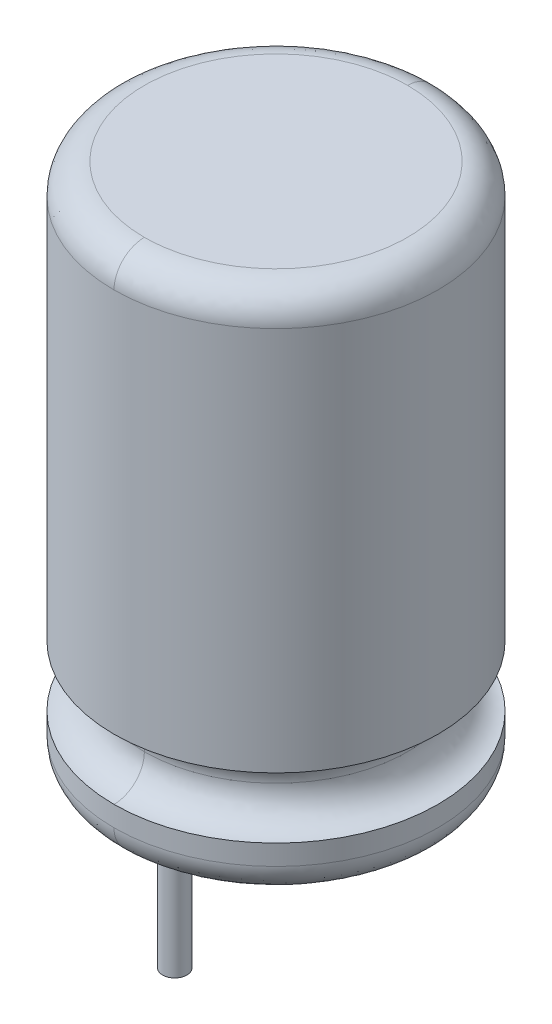
ISO-10303-21;
HEADER;
FILE_DESCRIPTION(('STEP AP214'),'2;1');
FILE_NAME('part.step','',(''),(''),'','','');
FILE_SCHEMA(('AUTOMOTIVE_DESIGN { 1 0 10303 214 1 1 1 1 }'));
ENDSEC;
DATA;
#1=APPLICATION_CONTEXT('core data for automotive mechanical design processes');
#2=APPLICATION_PROTOCOL_DEFINITION('international standard','automotive_design',2000,#1);
#3=PRODUCT_CONTEXT('',#1,'mechanical');
#4=PRODUCT('Part','Part','',(#3));
#5=PRODUCT_RELATED_PRODUCT_CATEGORY('part','',(#4));
#6=PRODUCT_DEFINITION_FORMATION('','',#4);
#7=PRODUCT_DEFINITION_CONTEXT('part definition',#1,'design');
#8=PRODUCT_DEFINITION('design','',#6,#7);
#9=PRODUCT_DEFINITION_SHAPE('','',#8);
#10=(LENGTH_UNIT() NAMED_UNIT(*) SI_UNIT(.MILLI.,.METRE.));
#11=(NAMED_UNIT(*) PLANE_ANGLE_UNIT() SI_UNIT($,.RADIAN.));
#12=(NAMED_UNIT(*) SI_UNIT($,.STERADIAN.) SOLID_ANGLE_UNIT());
#13=UNCERTAINTY_MEASURE_WITH_UNIT(LENGTH_MEASURE(1.E-05),#10,'distance_accuracy_value','');
#14=(GEOMETRIC_REPRESENTATION_CONTEXT(3) GLOBAL_UNCERTAINTY_ASSIGNED_CONTEXT((#13)) GLOBAL_UNIT_ASSIGNED_CONTEXT((#10,
#11,#12)) REPRESENTATION_CONTEXT('',''));
#15=CARTESIAN_POINT('',(0.,0.,0.));
#16=DIRECTION('',(0.,0.,1.));
#17=DIRECTION('',(1.,0.,0.));
#18=AXIS2_PLACEMENT_3D('',#15,#16,#17);
#19=CARTESIAN_POINT('',(0.3036,-3.,-2.8036));
#20=DIRECTION('',(0.,-1.,0.));
#21=DIRECTION('',(0.,0.,1.));
#22=AXIS2_PLACEMENT_3D('',#19,#20,#21);
#23=PLANE('',#22);
#24=CARTESIAN_POINT('',(0.,-3.,-2.5));
#25=DIRECTION('',(0.,1.,0.));
#26=DIRECTION('',(0.,0.,1.));
#27=AXIS2_PLACEMENT_3D('',#24,#25,#26);
#28=CIRCLE('',#27,0.3);
#29=CARTESIAN_POINT('',(0.,-3.,-2.2));
#30=VERTEX_POINT('',#29);
#31=EDGE_CURVE('E21',#30,#30,#28,.F.);
#32=ORIENTED_EDGE('',*,*,#31,.T.);
#33=EDGE_LOOP('',(#32));
#34=FACE_BOUND('',#33,.T.);
#35=ADVANCED_FACE('F16',(#34),#23,.T.);
#36=CARTESIAN_POINT('',(-0.3036,-3.,2.8036));
#37=DIRECTION('',(0.,-1.,0.));
#38=DIRECTION('',(0.,0.,-1.));
#39=AXIS2_PLACEMENT_3D('',#36,#37,#38);
#40=PLANE('',#39);
#41=CARTESIAN_POINT('',(0.,-3.,2.5));
#42=DIRECTION('',(0.,1.,0.));
#43=DIRECTION('',(0.,0.,1.));
#44=AXIS2_PLACEMENT_3D('',#41,#42,#43);
#45=CIRCLE('',#44,0.3);
#46=CARTESIAN_POINT('',(0.,-3.,2.8));
#47=VERTEX_POINT('',#46);
#48=EDGE_CURVE('E248',#47,#47,#45,.F.);
#49=ORIENTED_EDGE('',*,*,#48,.T.);
#50=EDGE_LOOP('',(#49));
#51=FACE_BOUND('',#50,.T.);
#52=ADVANCED_FACE('F193',(#51),#40,.T.);
#53=CARTESIAN_POINT('',(0.,2.074875062,3.253746876));
#54=CARTESIAN_POINT('',(-6.507493752,2.074875062,3.253746876));
#55=CARTESIAN_POINT('',(-6.507493752,2.074875062,-3.253746876));
#56=CARTESIAN_POINT('',(0.,2.074875062,-3.253746876));
#57=CARTESIAN_POINT('',(0.,1.564959676,3.202584683));
#58=CARTESIAN_POINT('',(-6.405169366,1.564959676,3.202584683));
#59=CARTESIAN_POINT('',(-6.405169366,1.564959676,-3.202584683));
#60=CARTESIAN_POINT('',(0.,1.564959676,-3.202584683));
#61=CARTESIAN_POINT('',(0.,1.202584683,3.564959676));
#62=CARTESIAN_POINT('',(-7.129919352,1.202584683,3.564959676));
#63=CARTESIAN_POINT('',(-7.129919352,1.202584683,-3.564959676));
#64=CARTESIAN_POINT('',(0.,1.202584683,-3.564959676));
#65=CARTESIAN_POINT('',(0.,1.253746876,4.074875062));
#66=CARTESIAN_POINT('',(-8.149750125,1.253746876,4.074875062));
#67=CARTESIAN_POINT('',(-8.149750125,1.253746876,-4.074875062));
#68=CARTESIAN_POINT('',(0.,1.253746876,-4.074875062));
#69=(BOUNDED_SURFACE() B_SPLINE_SURFACE(3,3,((#53,#54,#55,#56),(#57,#58,#59,#60),(#61,#62,#63,
#64),(#65,#66,#67,#68)),.UNSPECIFIED.,.F.,.F.,.F.) B_SPLINE_SURFACE_WITH_KNOTS((4,4),(4,4),(0.,
1.),(0.,1.),.UNSPECIFIED.) GEOMETRIC_REPRESENTATION_ITEM() RATIONAL_B_SPLINE_SURFACE(((1.,
0.333333333333333,0.333333333333333,1.),(0.755320871117972,0.251773623705991,0.251773623705991,
0.755320871117972),(0.755320871117972,0.251773623705991,0.251773623705991,0.755320871117972),
(1.,0.333333333333333,0.333333333333333,1.))) REPRESENTATION_ITEM('') SURFACE());
#70=CARTESIAN_POINT('',(0.,2.00000000077527,0.));
#71=DIRECTION('',(0.,-1.,0.));
#72=DIRECTION('',(1.,0.,0.));
#73=AXIS2_PLACEMENT_3D('',#70,#71,#72);
#74=CIRCLE('',#73,3.2499999999693);
#75=CARTESIAN_POINT('',(0.,2.,3.2499999999693));
#76=VERTEX_POINT('',#75);
#77=CARTESIAN_POINT('',(0.,2.,-3.2499999999693));
#78=VERTEX_POINT('',#77);
#79=EDGE_CURVE('E257',#76,#78,#74,.T.);
#80=CARTESIAN_POINT('',(0.,2.074875062,-3.253746876));
#81=CARTESIAN_POINT('',(0.,1.564959676,-3.202584683));
#82=CARTESIAN_POINT('',(0.,1.202584683,-3.564959676));
#83=CARTESIAN_POINT('',(0.,1.253746876,-4.074875062));
#84=(BOUNDED_CURVE() B_SPLINE_CURVE(3,(#80,#81,#82,#83),.UNSPECIFIED.,.F.,
.F.) B_SPLINE_CURVE_WITH_KNOTS((4,4),(0.,1.),
.UNSPECIFIED.) CURVE() GEOMETRIC_REPRESENTATION_ITEM() RATIONAL_B_SPLINE_CURVE((1.,
0.755320871117972,0.755320871117972,1.)) REPRESENTATION_ITEM(''));
#85=CARTESIAN_POINT('',(-4.78899351590904E-10,1.24999999997953,-3.99999999948316));
#86=VERTEX_POINT('',#85);
#87=EDGE_CURVE('E73',#86,#78,#84,.F.);
#88=CARTESIAN_POINT('',(0.,1.2499999999693,0.));
#89=DIRECTION('',(0.,-1.,0.));
#90=DIRECTION('',(1.,0.,0.));
#91=AXIS2_PLACEMENT_3D('',#88,#89,#90);
#92=CIRCLE('',#91,3.99999999922473);
#93=CARTESIAN_POINT('',(-1.64082742812265E-09,1.25,4.));
#94=VERTEX_POINT('',#93);
#95=EDGE_CURVE('E296',#94,#86,#92,.T.);
#96=CARTESIAN_POINT('',(0.,2.074875062,3.253746876));
#97=CARTESIAN_POINT('',(0.,1.564959676,3.202584683));
#98=CARTESIAN_POINT('',(0.,1.202584683,3.564959676));
#99=CARTESIAN_POINT('',(0.,1.253746876,4.074875062));
#100=(BOUNDED_CURVE() B_SPLINE_CURVE(3,(#96,#97,#98,#99),.UNSPECIFIED.,.F.,
.F.) B_SPLINE_CURVE_WITH_KNOTS((4,4),(0.,1.),
.UNSPECIFIED.) CURVE() GEOMETRIC_REPRESENTATION_ITEM() RATIONAL_B_SPLINE_CURVE((1.,
0.755320871117972,0.755320871117972,1.)) REPRESENTATION_ITEM(''));
#101=EDGE_CURVE('E100',#76,#94,#100,.T.);
#102=ORIENTED_EDGE('',*,*,#79,.T.);
#103=ORIENTED_EDGE('',*,*,#87,.F.);
#104=ORIENTED_EDGE('',*,*,#95,.F.);
#105=ORIENTED_EDGE('',*,*,#101,.F.);
#106=EDGE_LOOP('',(#102,#103,#104,#105));
#107=FACE_BOUND('',#106,.T.);
#108=ADVANCED_FACE('F183',(#107),#69,.F.);
#109=CARTESIAN_POINT('',(0.,0.824875062,-3.996253124));
#110=CARTESIAN_POINT('',(-7.992506248,0.824875062,-3.996253124));
#111=CARTESIAN_POINT('',(-7.992506248,0.824875062,3.996253124));
#112=CARTESIAN_POINT('',(0.,0.824875062,3.996253124));
#113=CARTESIAN_POINT('',(0.,0.314959676,-4.047415317));
#114=CARTESIAN_POINT('',(-8.094830634,0.314959676,-4.047415317));
#115=CARTESIAN_POINT('',(-8.094830634,0.314959676,4.047415317));
#116=CARTESIAN_POINT('',(0.,0.314959676,4.047415317));
#117=CARTESIAN_POINT('',(0.,-0.047415317,-3.685040324));
#118=CARTESIAN_POINT('',(-7.370080648,-0.047415317,-3.685040324));
#119=CARTESIAN_POINT('',(-7.370080648,-0.047415317,3.685040324));
#120=CARTESIAN_POINT('',(0.,-0.047415317,3.685040324));
#121=CARTESIAN_POINT('',(0.,0.003746876,-3.175124938));
#122=CARTESIAN_POINT('',(-6.350249875,0.003746876,-3.175124938));
#123=CARTESIAN_POINT('',(-6.350249875,0.003746876,3.175124938));
#124=CARTESIAN_POINT('',(0.,0.003746876,3.175124938));
#125=(BOUNDED_SURFACE() B_SPLINE_SURFACE(3,3,((#109,#110,#111,#112),(#113,#114,#115,#116),(#117,
#118,#119,#120),(#121,#122,#123,#124)),.UNSPECIFIED.,.F.,.F.,
.F.) B_SPLINE_SURFACE_WITH_KNOTS((4,4),(4,4),(0.,1.),(0.,1.),
.UNSPECIFIED.) GEOMETRIC_REPRESENTATION_ITEM() RATIONAL_B_SPLINE_SURFACE(((1.,0.333333333333333,
0.333333333333333,1.),(0.755320871117972,0.251773623705991,0.251773623705991,0.755320871117972),
(0.755320871117972,0.251773623705991,0.251773623705991,0.755320871117972),(1.,0.333333333333333,
0.333333333333333,1.))) REPRESENTATION_ITEM('') SURFACE());
#126=CARTESIAN_POINT('',(0.,0.824875062,3.996253124));
#127=CARTESIAN_POINT('',(0.,0.314959676,4.047415317));
#128=CARTESIAN_POINT('',(0.,-0.047415317,3.685040324));
#129=CARTESIAN_POINT('',(0.,0.003746876,3.175124938));
#130=(BOUNDED_CURVE() B_SPLINE_CURVE(3,(#126,#127,#128,#129),.UNSPECIFIED.,.F.,
.F.) B_SPLINE_CURVE_WITH_KNOTS((4,4),(0.,1.),
.UNSPECIFIED.) CURVE() GEOMETRIC_REPRESENTATION_ITEM() RATIONAL_B_SPLINE_CURVE((1.,
0.755320871117972,0.755320871117972,1.)) REPRESENTATION_ITEM(''));
#131=CARTESIAN_POINT('',(0.,-1.84214021285393E-11,3.24999999990695));
#132=VERTEX_POINT('',#131);
#133=CARTESIAN_POINT('',(-4.10206857030662E-10,0.749999999418551,4.00000000001535));
#134=VERTEX_POINT('',#133);
#135=EDGE_CURVE('E93',#132,#134,#130,.F.);
#136=CARTESIAN_POINT('',(0.,0.749999999224735,0.));
#137=DIRECTION('',(0.,-1.,0.));
#138=DIRECTION('',(1.,0.,0.));
#139=AXIS2_PLACEMENT_3D('',#136,#137,#138);
#140=CIRCLE('',#139,4.0000000000307);
#141=CARTESIAN_POINT('',(-2.69380885286544E-10,0.749999999483157,-4.00000000001535));
#142=VERTEX_POINT('',#141);
#143=EDGE_CURVE('E82',#134,#142,#140,.T.);
#144=CARTESIAN_POINT('',(0.,0.824875062,-3.996253124));
#145=CARTESIAN_POINT('',(0.,0.314959676,-4.047415317));
#146=CARTESIAN_POINT('',(0.,-0.047415317,-3.685040324));
#147=CARTESIAN_POINT('',(0.,0.003746876,-3.175124938));
#148=(BOUNDED_CURVE() B_SPLINE_CURVE(3,(#144,#145,#146,#147),.UNSPECIFIED.,.F.,
.F.) B_SPLINE_CURVE_WITH_KNOTS((4,4),(0.,1.),
.UNSPECIFIED.) CURVE() GEOMETRIC_REPRESENTATION_ITEM() RATIONAL_B_SPLINE_CURVE((1.,
0.755320871117972,0.755320871117972,1.)) REPRESENTATION_ITEM(''));
#149=CARTESIAN_POINT('',(0.,-1.84214021285393E-11,-3.24999999990695));
#150=VERTEX_POINT('',#149);
#151=EDGE_CURVE('E91',#142,#150,#148,.T.);
#152=CARTESIAN_POINT('',(0.,-3.07023371557678E-11,-3.25000000099174));
#153=CARTESIAN_POINT('',(-6.50000000112388,-3.07023432738572E-11,-3.25000000099174));
#154=CARTESIAN_POINT('',(-6.50000000112388,-3.07023432738572E-11,3.25000000099174));
#155=CARTESIAN_POINT('',(0.,-3.07023371557678E-11,3.25000000099174));
#156=(BOUNDED_CURVE() B_SPLINE_CURVE(3,(#152,#153,#154,#155),.UNSPECIFIED.,.F.,
.F.) B_SPLINE_CURVE_WITH_KNOTS((4,4),(0.,1.),
.UNSPECIFIED.) CURVE() GEOMETRIC_REPRESENTATION_ITEM() RATIONAL_B_SPLINE_CURVE((0.956578302051627,
0.318859434017209,0.318859434017209,0.956578302051627)) REPRESENTATION_ITEM(''));
#157=EDGE_CURVE('E233',#150,#132,#156,.T.);
#158=ORIENTED_EDGE('',*,*,#135,.T.);
#159=ORIENTED_EDGE('',*,*,#143,.T.);
#160=ORIENTED_EDGE('',*,*,#151,.T.);
#161=ORIENTED_EDGE('',*,*,#157,.T.);
#162=EDGE_LOOP('',(#158,#159,#160,#161));
#163=FACE_BOUND('',#162,.T.);
#164=ADVANCED_FACE('F89',(#163),#125,.T.);
#165=CARTESIAN_POINT('',(0.,-3.,-2.5));
#166=DIRECTION('',(0.,1.,0.));
#167=DIRECTION('',(0.,0.,1.));
#168=AXIS2_PLACEMENT_3D('',#165,#166,#167);
#169=CYLINDRICAL_SURFACE('',#168,0.3);
#170=CARTESIAN_POINT('',(0.,0.,-2.5));
#171=DIRECTION('',(0.,1.,0.));
#172=DIRECTION('',(0.,0.,1.));
#173=AXIS2_PLACEMENT_3D('',#170,#171,#172);
#174=CIRCLE('',#173,0.3);
#175=CARTESIAN_POINT('',(0.,0.,-2.2));
#176=VERTEX_POINT('',#175);
#177=EDGE_CURVE('E246',#176,#176,#174,.F.);
#178=ORIENTED_EDGE('',*,*,#177,.T.);
#179=EDGE_LOOP('',(#178));
#180=FACE_BOUND('',#179,.T.);
#181=ORIENTED_EDGE('',*,*,#31,.F.);
#182=EDGE_LOOP('',(#181));
#183=FACE_BOUND('',#182,.T.);
#184=ADVANCED_FACE('F174',(#180,#183),#169,.T.);
#185=CARTESIAN_POINT('',(0.,-3.,2.5));
#186=DIRECTION('',(0.,1.,0.));
#187=DIRECTION('',(0.,0.,1.));
#188=AXIS2_PLACEMENT_3D('',#185,#186,#187);
#189=CYLINDRICAL_SURFACE('',#188,0.3);
#190=ORIENTED_EDGE('',*,*,#48,.F.);
#191=EDGE_LOOP('',(#190));
#192=FACE_BOUND('',#191,.T.);
#193=CARTESIAN_POINT('',(0.,0.,2.5));
#194=DIRECTION('',(0.,1.,0.));
#195=DIRECTION('',(0.,0.,1.));
#196=AXIS2_PLACEMENT_3D('',#193,#194,#195);
#197=CIRCLE('',#196,0.3);
#198=CARTESIAN_POINT('',(0.,0.,2.8));
#199=VERTEX_POINT('',#198);
#200=EDGE_CURVE('E237',#199,#199,#197,.F.);
#201=ORIENTED_EDGE('',*,*,#200,.T.);
#202=EDGE_LOOP('',(#201));
#203=FACE_BOUND('',#202,.T.);
#204=ADVANCED_FACE('F165',(#192,#203),#189,.T.);
#205=CARTESIAN_POINT('',(0.,2.746253124,4.074875062));
#206=CARTESIAN_POINT('',(-8.149750125,2.746253124,4.074875062));
#207=CARTESIAN_POINT('',(-8.149750125,2.746253124,-4.074875062));
#208=CARTESIAN_POINT('',(0.,2.746253124,-4.074875062));
#209=CARTESIAN_POINT('',(0.,2.797415317,3.564959676));
#210=CARTESIAN_POINT('',(-7.129919352,2.797415317,3.564959676));
#211=CARTESIAN_POINT('',(-7.129919352,2.797415317,-3.564959676));
#212=CARTESIAN_POINT('',(0.,2.797415317,-3.564959676));
#213=CARTESIAN_POINT('',(0.,2.435040324,3.202584683));
#214=CARTESIAN_POINT('',(-6.405169366,2.435040324,3.202584683));
#215=CARTESIAN_POINT('',(-6.405169366,2.435040324,-3.202584683));
#216=CARTESIAN_POINT('',(0.,2.435040324,-3.202584683));
#217=CARTESIAN_POINT('',(0.,1.925124938,3.253746876));
#218=CARTESIAN_POINT('',(-6.507493752,1.925124938,3.253746876));
#219=CARTESIAN_POINT('',(-6.507493752,1.925124938,-3.253746876));
#220=CARTESIAN_POINT('',(0.,1.925124938,-3.253746876));
#221=(BOUNDED_SURFACE() B_SPLINE_SURFACE(3,3,((#205,#206,#207,#208),(#209,#210,#211,#212),(#213,
#214,#215,#216),(#217,#218,#219,#220)),.UNSPECIFIED.,.F.,.F.,
.F.) B_SPLINE_SURFACE_WITH_KNOTS((4,4),(4,4),(0.,1.),(0.,1.),
.UNSPECIFIED.) GEOMETRIC_REPRESENTATION_ITEM() RATIONAL_B_SPLINE_SURFACE(((1.,0.333333333333333,
0.333333333333333,1.),(0.755320871117972,0.251773623705991,0.251773623705991,0.755320871117972),
(0.755320871117972,0.251773623705991,0.251773623705991,0.755320871117972),(1.,0.333333333333333,
0.333333333333333,1.))) REPRESENTATION_ITEM('') SURFACE());
#222=CARTESIAN_POINT('',(0.,2.746253124,4.074875062));
#223=CARTESIAN_POINT('',(0.,2.797415317,3.564959676));
#224=CARTESIAN_POINT('',(0.,2.435040324,3.202584683));
#225=CARTESIAN_POINT('',(0.,1.925124938,3.253746876));
#226=(BOUNDED_CURVE() B_SPLINE_CURVE(3,(#222,#223,#224,#225),.UNSPECIFIED.,.F.,
.F.) B_SPLINE_CURVE_WITH_KNOTS((4,4),(0.,1.),
.UNSPECIFIED.) CURVE() GEOMETRIC_REPRESENTATION_ITEM() RATIONAL_B_SPLINE_CURVE((1.,
0.755320871117972,0.755320871117972,1.)) REPRESENTATION_ITEM(''));
#227=CARTESIAN_POINT('',(-6.15310285545994E-10,2.75000000001919,3.99999999951546));
#228=VERTEX_POINT('',#227);
#229=EDGE_CURVE('E251',#228,#76,#226,.T.);
#230=CARTESIAN_POINT('',(0.,2.75,0.));
#231=DIRECTION('',(0.,-1.,0.));
#232=DIRECTION('',(0.,0.,-1.));
#233=AXIS2_PLACEMENT_3D('',#230,#231,#232);
#234=CIRCLE('',#233,4.);
#235=CARTESIAN_POINT('',(-1.79587256857466E-10,2.75000000001919,-3.99999999951546));
#236=VERTEX_POINT('',#235);
#237=EDGE_CURVE('E245',#228,#236,#234,.T.);
#238=CARTESIAN_POINT('',(0.,2.746253124,-4.074875062));
#239=CARTESIAN_POINT('',(0.,2.797415317,-3.564959676));
#240=CARTESIAN_POINT('',(0.,2.435040324,-3.202584683));
#241=CARTESIAN_POINT('',(0.,1.925124938,-3.253746876));
#242=(BOUNDED_CURVE() B_SPLINE_CURVE(3,(#238,#239,#240,#241),.UNSPECIFIED.,.F.,
.F.) B_SPLINE_CURVE_WITH_KNOTS((4,4),(0.,1.),
.UNSPECIFIED.) CURVE() GEOMETRIC_REPRESENTATION_ITEM() RATIONAL_B_SPLINE_CURVE((1.,
0.755320871117972,0.755320871117972,1.)) REPRESENTATION_ITEM(''));
#243=EDGE_CURVE('E35',#78,#236,#242,.F.);
#244=ORIENTED_EDGE('',*,*,#229,.F.);
#245=ORIENTED_EDGE('',*,*,#237,.T.);
#246=ORIENTED_EDGE('',*,*,#243,.F.);
#247=ORIENTED_EDGE('',*,*,#79,.F.);
#248=EDGE_LOOP('',(#244,#245,#246,#247));
#249=FACE_BOUND('',#248,.T.);
#250=ADVANCED_FACE('F150',(#249),#221,.F.);
#251=CARTESIAN_POINT('',(0.,12.996253124,-3.175124938));
#252=CARTESIAN_POINT('',(-6.350249875,12.996253124,-3.175124938));
#253=CARTESIAN_POINT('',(-6.350249875,12.996253124,3.175124938));
#254=CARTESIAN_POINT('',(0.,12.996253124,3.175124938));
#255=CARTESIAN_POINT('',(0.,13.047415317,-3.685040324));
#256=CARTESIAN_POINT('',(-7.370080648,13.047415317,-3.685040324));
#257=CARTESIAN_POINT('',(-7.370080648,13.047415317,3.685040324));
#258=CARTESIAN_POINT('',(0.,13.047415317,3.685040324));
#259=CARTESIAN_POINT('',(0.,12.685040324,-4.047415317));
#260=CARTESIAN_POINT('',(-8.094830634,12.685040324,-4.047415317));
#261=CARTESIAN_POINT('',(-8.094830634,12.685040324,4.047415317));
#262=CARTESIAN_POINT('',(0.,12.685040324,4.047415317));
#263=CARTESIAN_POINT('',(0.,12.175124938,-3.996253124));
#264=CARTESIAN_POINT('',(-7.992506248,12.175124938,-3.996253124));
#265=CARTESIAN_POINT('',(-7.992506248,12.175124938,3.996253124));
#266=CARTESIAN_POINT('',(0.,12.175124938,3.996253124));
#267=(BOUNDED_SURFACE() B_SPLINE_SURFACE(3,3,((#251,#252,#253,#254),(#255,#256,#257,#258),(#259,
#260,#261,#262),(#263,#264,#265,#266)),.UNSPECIFIED.,.F.,.F.,
.F.) B_SPLINE_SURFACE_WITH_KNOTS((4,4),(4,4),(0.,1.),(0.,1.),
.UNSPECIFIED.) GEOMETRIC_REPRESENTATION_ITEM() RATIONAL_B_SPLINE_SURFACE(((1.,0.333333333333333,
0.333333333333333,1.),(0.755320871117972,0.251773623705991,0.251773623705991,0.755320871117972),
(0.755320871117972,0.251773623705991,0.251773623705991,0.755320871117972),(1.,0.333333333333333,
0.333333333333333,1.))) REPRESENTATION_ITEM('') SURFACE());
#268=CARTESIAN_POINT('',(0.,12.996253124,3.175124938));
#269=CARTESIAN_POINT('',(0.,13.047415317,3.685040324));
#270=CARTESIAN_POINT('',(0.,12.685040324,4.047415317));
#271=CARTESIAN_POINT('',(0.,12.175124938,3.996253124));
#272=(BOUNDED_CURVE() B_SPLINE_CURVE(3,(#268,#269,#270,#271),.UNSPECIFIED.,.F.,
.F.) B_SPLINE_CURVE_WITH_KNOTS((4,4),(0.,1.),
.UNSPECIFIED.) CURVE() GEOMETRIC_REPRESENTATION_ITEM() RATIONAL_B_SPLINE_CURVE((1.,
0.755320871117972,0.755320871117972,1.)) REPRESENTATION_ITEM(''));
#273=CARTESIAN_POINT('',(0.,12.2500000004845,4.0000000000307));
#274=VERTEX_POINT('',#273);
#275=CARTESIAN_POINT('',(0.,13.0000000000184,3.24999999990695));
#276=VERTEX_POINT('',#275);
#277=EDGE_CURVE('E135',#274,#276,#272,.F.);
#278=CARTESIAN_POINT('',(0.,13.0000000000307,3.25000000099174));
#279=CARTESIAN_POINT('',(-6.50000000112388,13.0000000000307,3.25000000099174));
#280=CARTESIAN_POINT('',(-6.50000000112388,13.0000000000307,-3.25000000099174));
#281=CARTESIAN_POINT('',(0.,13.0000000000307,-3.25000000099174));
#282=(BOUNDED_CURVE() B_SPLINE_CURVE(3,(#278,#279,#280,#281),.UNSPECIFIED.,.F.,
.F.) B_SPLINE_CURVE_WITH_KNOTS((4,4),(0.,1.),
.UNSPECIFIED.) CURVE() GEOMETRIC_REPRESENTATION_ITEM() RATIONAL_B_SPLINE_CURVE((0.956578302051627,
0.318859434017209,0.318859434017209,0.956578302051627)) REPRESENTATION_ITEM(''));
#283=CARTESIAN_POINT('',(0.,13.0000000000184,-3.24999999990695));
#284=VERTEX_POINT('',#283);
#285=EDGE_CURVE('E129',#284,#276,#282,.F.);
#286=CARTESIAN_POINT('',(0.,12.996253124,-3.175124938));
#287=CARTESIAN_POINT('',(0.,13.047415317,-3.685040324));
#288=CARTESIAN_POINT('',(0.,12.685040324,-4.047415317));
#289=CARTESIAN_POINT('',(0.,12.175124938,-3.996253124));
#290=(BOUNDED_CURVE() B_SPLINE_CURVE(3,(#286,#287,#288,#289),.UNSPECIFIED.,.F.,
.F.) B_SPLINE_CURVE_WITH_KNOTS((4,4),(0.,1.),
.UNSPECIFIED.) CURVE() GEOMETRIC_REPRESENTATION_ITEM() RATIONAL_B_SPLINE_CURVE((1.,
0.755320871117972,0.755320871117972,1.)) REPRESENTATION_ITEM(''));
#291=CARTESIAN_POINT('',(-1.19724837904403E-10,12.2500000001615,-4.00000000001023));
#292=VERTEX_POINT('',#291);
#293=EDGE_CURVE('E268',#284,#292,#290,.T.);
#294=CARTESIAN_POINT('',(0.,12.25,0.));
#295=DIRECTION('',(0.,-1.,0.));
#296=DIRECTION('',(0.,0.,-1.));
#297=AXIS2_PLACEMENT_3D('',#294,#295,#296);
#298=CIRCLE('',#297,4.);
#299=EDGE_CURVE('E280',#292,#274,#298,.F.);
#300=ORIENTED_EDGE('',*,*,#277,.T.);
#301=ORIENTED_EDGE('',*,*,#285,.F.);
#302=ORIENTED_EDGE('',*,*,#293,.T.);
#303=ORIENTED_EDGE('',*,*,#299,.T.);
#304=EDGE_LOOP('',(#300,#301,#302,#303));
#305=FACE_BOUND('',#304,.T.);
#306=ADVANCED_FACE('F137',(#305),#267,.T.);
#307=CARTESIAN_POINT('',(-3.289,13.,-3.289));
#308=DIRECTION('',(0.,1.,0.));
#309=DIRECTION('',(0.,0.,1.));
#310=AXIS2_PLACEMENT_3D('',#307,#308,#309);
#311=PLANE('',#310);
#312=CARTESIAN_POINT('',(0.,13.0000000000307,-3.25000000099174));
#313=CARTESIAN_POINT('',(6.50000000112388,13.0000000000307,-3.25000000099174));
#314=CARTESIAN_POINT('',(6.50000000112388,13.0000000000307,3.25000000099174));
#315=CARTESIAN_POINT('',(0.,13.0000000000307,3.25000000099174));
#316=(BOUNDED_CURVE() B_SPLINE_CURVE(3,(#312,#313,#314,#315),.UNSPECIFIED.,.F.,
.F.) B_SPLINE_CURVE_WITH_KNOTS((4,4),(0.,1.),
.UNSPECIFIED.) CURVE() GEOMETRIC_REPRESENTATION_ITEM() RATIONAL_B_SPLINE_CURVE((0.956578302051627,
0.318859434017209,0.318859434017209,0.956578302051627)) REPRESENTATION_ITEM(''));
#317=EDGE_CURVE('E285',#284,#276,#316,.T.);
#318=ORIENTED_EDGE('',*,*,#317,.F.);
#319=ORIENTED_EDGE('',*,*,#285,.T.);
#320=EDGE_LOOP('',(#318,#319));
#321=FACE_BOUND('',#320,.T.);
#322=ADVANCED_FACE('F149',(#321),#311,.T.);
#323=CARTESIAN_POINT('',(-3.289,0.,-3.289));
#324=DIRECTION('',(0.,1.,0.));
#325=DIRECTION('',(0.,0.,1.));
#326=AXIS2_PLACEMENT_3D('',#323,#324,#325);
#327=PLANE('',#326);
#328=ORIENTED_EDGE('',*,*,#200,.F.);
#329=EDGE_LOOP('',(#328));
#330=FACE_BOUND('',#329,.T.);
#331=ORIENTED_EDGE('',*,*,#177,.F.);
#332=EDGE_LOOP('',(#331));
#333=FACE_BOUND('',#332,.T.);
#334=CARTESIAN_POINT('',(0.,-3.07023364895319E-11,3.25000000099174));
#335=CARTESIAN_POINT('',(6.50000000112388,-3.07023432622993E-11,3.25000000099174));
#336=CARTESIAN_POINT('',(6.50000000112388,-3.07023432622993E-11,-3.25000000099174));
#337=CARTESIAN_POINT('',(0.,-3.07023364895319E-11,-3.25000000099174));
#338=(BOUNDED_CURVE() B_SPLINE_CURVE(3,(#334,#335,#336,#337),.UNSPECIFIED.,.F.,
.F.) B_SPLINE_CURVE_WITH_KNOTS((4,4),(0.,1.),
.UNSPECIFIED.) CURVE() GEOMETRIC_REPRESENTATION_ITEM() RATIONAL_B_SPLINE_CURVE((0.956578302051627,
0.318859434017209,0.318859434017209,0.956578302051627)) REPRESENTATION_ITEM(''));
#339=EDGE_CURVE('E98',#132,#150,#338,.T.);
#340=ORIENTED_EDGE('',*,*,#339,.F.);
#341=ORIENTED_EDGE('',*,*,#157,.F.);
#342=EDGE_LOOP('',(#340,#341));
#343=FACE_BOUND('',#342,.T.);
#344=ADVANCED_FACE('F18',(#330,#333,#343),#327,.F.);
#345=CARTESIAN_POINT('',(0.,12.996253124,3.175124938));
#346=CARTESIAN_POINT('',(6.350249875,12.996253124,3.175124938));
#347=CARTESIAN_POINT('',(6.350249875,12.996253124,-3.175124938));
#348=CARTESIAN_POINT('',(0.,12.996253124,-3.175124938));
#349=CARTESIAN_POINT('',(0.,13.047415317,3.685040324));
#350=CARTESIAN_POINT('',(7.370080648,13.047415317,3.685040324));
#351=CARTESIAN_POINT('',(7.370080648,13.047415317,-3.685040324));
#352=CARTESIAN_POINT('',(0.,13.047415317,-3.685040324));
#353=CARTESIAN_POINT('',(0.,12.685040324,4.047415317));
#354=CARTESIAN_POINT('',(8.094830634,12.685040324,4.047415317));
#355=CARTESIAN_POINT('',(8.094830634,12.685040324,-4.047415317));
#356=CARTESIAN_POINT('',(0.,12.685040324,-4.047415317));
#357=CARTESIAN_POINT('',(0.,12.175124938,3.996253124));
#358=CARTESIAN_POINT('',(7.992506248,12.175124938,3.996253124));
#359=CARTESIAN_POINT('',(7.992506248,12.175124938,-3.996253124));
#360=CARTESIAN_POINT('',(0.,12.175124938,-3.996253124));
#361=(BOUNDED_SURFACE() B_SPLINE_SURFACE(3,3,((#345,#346,#347,#348),(#349,#350,#351,#352),(#353,
#354,#355,#356),(#357,#358,#359,#360)),.UNSPECIFIED.,.F.,.F.,
.F.) B_SPLINE_SURFACE_WITH_KNOTS((4,4),(4,4),(0.,1.),(0.,1.),
.UNSPECIFIED.) GEOMETRIC_REPRESENTATION_ITEM() RATIONAL_B_SPLINE_SURFACE(((1.,0.333333333333333,
0.333333333333333,1.),(0.755320871117972,0.251773623705991,0.251773623705991,0.755320871117972),
(0.755320871117972,0.251773623705991,0.251773623705991,0.755320871117972),(1.,0.333333333333333,
0.333333333333333,1.))) REPRESENTATION_ITEM('') SURFACE());
#362=CARTESIAN_POINT('',(0.,12.25,0.));
#363=DIRECTION('',(0.,-1.,0.));
#364=DIRECTION('',(0.,0.,-1.));
#365=AXIS2_PLACEMENT_3D('',#362,#363,#364);
#366=CIRCLE('',#365,4.);
#367=EDGE_CURVE('E86',#274,#292,#366,.F.);
#368=ORIENTED_EDGE('',*,*,#317,.T.);
#369=ORIENTED_EDGE('',*,*,#277,.F.);
#370=ORIENTED_EDGE('',*,*,#367,.T.);
#371=ORIENTED_EDGE('',*,*,#293,.F.);
#372=EDGE_LOOP('',(#368,#369,#370,#371));
#373=FACE_BOUND('',#372,.T.);
#374=ADVANCED_FACE('F151',(#373),#361,.T.);
#375=CARTESIAN_POINT('',(0.,0.824875062,3.996253124));
#376=CARTESIAN_POINT('',(7.992506248,0.824875062,3.996253124));
#377=CARTESIAN_POINT('',(7.992506248,0.824875062,-3.996253124));
#378=CARTESIAN_POINT('',(0.,0.824875062,-3.996253124));
#379=CARTESIAN_POINT('',(0.,0.314959676,4.047415317));
#380=CARTESIAN_POINT('',(8.094830634,0.314959676,4.047415317));
#381=CARTESIAN_POINT('',(8.094830634,0.314959676,-4.047415317));
#382=CARTESIAN_POINT('',(0.,0.314959676,-4.047415317));
#383=CARTESIAN_POINT('',(0.,-0.047415317,3.685040324));
#384=CARTESIAN_POINT('',(7.370080648,-0.047415317,3.685040324));
#385=CARTESIAN_POINT('',(7.370080648,-0.047415317,-3.685040324));
#386=CARTESIAN_POINT('',(0.,-0.047415317,-3.685040324));
#387=CARTESIAN_POINT('',(0.,0.003746876,3.175124938));
#388=CARTESIAN_POINT('',(6.350249875,0.003746876,3.175124938));
#389=CARTESIAN_POINT('',(6.350249875,0.003746876,-3.175124938));
#390=CARTESIAN_POINT('',(0.,0.003746876,-3.175124938));
#391=(BOUNDED_SURFACE() B_SPLINE_SURFACE(3,3,((#375,#376,#377,#378),(#379,#380,#381,#382),(#383,
#384,#385,#386),(#387,#388,#389,#390)),.UNSPECIFIED.,.F.,.F.,
.F.) B_SPLINE_SURFACE_WITH_KNOTS((4,4),(4,4),(0.,1.),(0.,1.),
.UNSPECIFIED.) GEOMETRIC_REPRESENTATION_ITEM() RATIONAL_B_SPLINE_SURFACE(((1.,0.333333333333333,
0.333333333333333,1.),(0.755320871117972,0.251773623705991,0.251773623705991,0.755320871117972),
(0.755320871117972,0.251773623705991,0.251773623705991,0.755320871117972),(1.,0.333333333333333,
0.333333333333333,1.))) REPRESENTATION_ITEM('') SURFACE());
#392=CARTESIAN_POINT('',(0.,0.750000000000001,0.));
#393=DIRECTION('',(0.,-1.,0.));
#394=DIRECTION('',(0.,0.,-1.));
#395=AXIS2_PLACEMENT_3D('',#392,#393,#394);
#396=CIRCLE('',#395,4.);
#397=EDGE_CURVE('E79',#142,#134,#396,.T.);
#398=ORIENTED_EDGE('',*,*,#397,.T.);
#399=ORIENTED_EDGE('',*,*,#135,.F.);
#400=ORIENTED_EDGE('',*,*,#339,.T.);
#401=ORIENTED_EDGE('',*,*,#151,.F.);
#402=EDGE_LOOP('',(#398,#399,#400,#401));
#403=FACE_BOUND('',#402,.T.);
#404=ADVANCED_FACE('F96',(#403),#391,.T.);
#405=CARTESIAN_POINT('',(0.,12.25,0.));
#406=DIRECTION('',(0.,-1.,0.));
#407=DIRECTION('',(1.,0.,0.));
#408=AXIS2_PLACEMENT_3D('',#405,#406,#407);
#409=CYLINDRICAL_SURFACE('',#408,4.);
#410=CARTESIAN_POINT('',(0.,2.7500000000307,0.));
#411=DIRECTION('',(0.,1.,0.));
#412=DIRECTION('',(-1.,0.,0.));
#413=AXIS2_PLACEMENT_3D('',#410,#411,#412);
#414=CIRCLE('',#413,3.99999999922473);
#415=EDGE_CURVE('E85',#228,#236,#414,.T.);
#416=ORIENTED_EDGE('',*,*,#415,.T.);
#417=ORIENTED_EDGE('',*,*,#237,.F.);
#418=EDGE_LOOP('',(#416,#417));
#419=FACE_BOUND('',#418,.T.);
#420=ORIENTED_EDGE('',*,*,#367,.F.);
#421=ORIENTED_EDGE('',*,*,#299,.F.);
#422=EDGE_LOOP('',(#420,#421));
#423=FACE_BOUND('',#422,.T.);
#424=ADVANCED_FACE('F343',(#419,#423),#409,.T.);
#425=CARTESIAN_POINT('',(0.,1.25,0.));
#426=DIRECTION('',(0.,-1.,0.));
#427=DIRECTION('',(1.,0.,0.));
#428=AXIS2_PLACEMENT_3D('',#425,#426,#427);
#429=CYLINDRICAL_SURFACE('',#428,4.);
#430=ORIENTED_EDGE('',*,*,#95,.T.);
#431=CARTESIAN_POINT('',(0.,1.2499999999693,0.));
#432=DIRECTION('',(0.,-1.,0.));
#433=DIRECTION('',(1.,0.,0.));
#434=AXIS2_PLACEMENT_3D('',#431,#432,#433);
#435=CIRCLE('',#434,3.99999999922473);
#436=EDGE_CURVE('E27',#86,#94,#435,.T.);
#437=ORIENTED_EDGE('',*,*,#436,.T.);
#438=EDGE_LOOP('',(#430,#437));
#439=FACE_BOUND('',#438,.T.);
#440=ORIENTED_EDGE('',*,*,#397,.F.);
#441=ORIENTED_EDGE('',*,*,#143,.F.);
#442=EDGE_LOOP('',(#440,#441));
#443=FACE_BOUND('',#442,.T.);
#444=ADVANCED_FACE('F81',(#439,#443),#429,.T.);
#445=CARTESIAN_POINT('',(0.,2.746253124,-4.074875062));
#446=CARTESIAN_POINT('',(8.149750125,2.746253124,-4.074875062));
#447=CARTESIAN_POINT('',(8.149750125,2.746253124,4.074875062));
#448=CARTESIAN_POINT('',(0.,2.746253124,4.074875062));
#449=CARTESIAN_POINT('',(0.,2.797415317,-3.564959676));
#450=CARTESIAN_POINT('',(7.129919352,2.797415317,-3.564959676));
#451=CARTESIAN_POINT('',(7.129919352,2.797415317,3.564959676));
#452=CARTESIAN_POINT('',(0.,2.797415317,3.564959676));
#453=CARTESIAN_POINT('',(0.,2.435040324,-3.202584683));
#454=CARTESIAN_POINT('',(6.405169366,2.435040324,-3.202584683));
#455=CARTESIAN_POINT('',(6.405169366,2.435040324,3.202584683));
#456=CARTESIAN_POINT('',(0.,2.435040324,3.202584683));
#457=CARTESIAN_POINT('',(0.,1.925124938,-3.253746876));
#458=CARTESIAN_POINT('',(6.507493752,1.925124938,-3.253746876));
#459=CARTESIAN_POINT('',(6.507493752,1.925124938,3.253746876));
#460=CARTESIAN_POINT('',(0.,1.925124938,3.253746876));
#461=(BOUNDED_SURFACE() B_SPLINE_SURFACE(3,3,((#445,#446,#447,#448),(#449,#450,#451,#452),(#453,
#454,#455,#456),(#457,#458,#459,#460)),.UNSPECIFIED.,.F.,.F.,
.F.) B_SPLINE_SURFACE_WITH_KNOTS((4,4),(4,4),(0.,1.),(0.,1.),
.UNSPECIFIED.) GEOMETRIC_REPRESENTATION_ITEM() RATIONAL_B_SPLINE_SURFACE(((1.,0.333333333333333,
0.333333333333333,1.),(0.755320871117972,0.251773623705991,0.251773623705991,0.755320871117972),
(0.755320871117972,0.251773623705991,0.251773623705991,0.755320871117972),(1.,0.333333333333333,
0.333333333333333,1.))) REPRESENTATION_ITEM('') SURFACE());
#462=CARTESIAN_POINT('',(0.,1.99999999922473,0.));
#463=DIRECTION('',(0.,1.,0.));
#464=DIRECTION('',(-1.,0.,0.));
#465=AXIS2_PLACEMENT_3D('',#462,#463,#464);
#466=CIRCLE('',#465,3.2499999999693);
#467=EDGE_CURVE('E11',#76,#78,#466,.T.);
#468=ORIENTED_EDGE('',*,*,#243,.T.);
#469=ORIENTED_EDGE('',*,*,#415,.F.);
#470=ORIENTED_EDGE('',*,*,#229,.T.);
#471=ORIENTED_EDGE('',*,*,#467,.T.);
#472=EDGE_LOOP('',(#468,#469,#470,#471));
#473=FACE_BOUND('',#472,.T.);
#474=ADVANCED_FACE('F354',(#473),#461,.F.);
#475=CARTESIAN_POINT('',(0.,2.074875062,-3.253746876));
#476=CARTESIAN_POINT('',(6.507493752,2.074875062,-3.253746876));
#477=CARTESIAN_POINT('',(6.507493752,2.074875062,3.253746876));
#478=CARTESIAN_POINT('',(0.,2.074875062,3.253746876));
#479=CARTESIAN_POINT('',(0.,1.564959676,-3.202584683));
#480=CARTESIAN_POINT('',(6.405169366,1.564959676,-3.202584683));
#481=CARTESIAN_POINT('',(6.405169366,1.564959676,3.202584683));
#482=CARTESIAN_POINT('',(0.,1.564959676,3.202584683));
#483=CARTESIAN_POINT('',(0.,1.202584683,-3.564959676));
#484=CARTESIAN_POINT('',(7.129919352,1.202584683,-3.564959676));
#485=CARTESIAN_POINT('',(7.129919352,1.202584683,3.564959676));
#486=CARTESIAN_POINT('',(0.,1.202584683,3.564959676));
#487=CARTESIAN_POINT('',(0.,1.253746876,-4.074875062));
#488=CARTESIAN_POINT('',(8.149750125,1.253746876,-4.074875062));
#489=CARTESIAN_POINT('',(8.149750125,1.253746876,4.074875062));
#490=CARTESIAN_POINT('',(0.,1.253746876,4.074875062));
#491=(BOUNDED_SURFACE() B_SPLINE_SURFACE(3,3,((#475,#476,#477,#478),(#479,#480,#481,#482),(#483,
#484,#485,#486),(#487,#488,#489,#490)),.UNSPECIFIED.,.F.,.F.,
.F.) B_SPLINE_SURFACE_WITH_KNOTS((4,4),(4,4),(0.,1.),(0.,1.),
.UNSPECIFIED.) GEOMETRIC_REPRESENTATION_ITEM() RATIONAL_B_SPLINE_SURFACE(((1.,0.333333333333333,
0.333333333333333,1.),(0.755320871117972,0.251773623705991,0.251773623705991,0.755320871117972),
(0.755320871117972,0.251773623705991,0.251773623705991,0.755320871117972),(1.,0.333333333333333,
0.333333333333333,1.))) REPRESENTATION_ITEM('') SURFACE());
#492=ORIENTED_EDGE('',*,*,#467,.F.);
#493=ORIENTED_EDGE('',*,*,#101,.T.);
#494=ORIENTED_EDGE('',*,*,#436,.F.);
#495=ORIENTED_EDGE('',*,*,#87,.T.);
#496=EDGE_LOOP('',(#492,#493,#494,#495));
#497=FACE_BOUND('',#496,.T.);
#498=ADVANCED_FACE('F360',(#497),#491,.F.);
#499=CLOSED_SHELL('',(#35,#52,#108,#164,#184,#204,#250,#306,#322,#344,#374,#404,#424,#444,#474,#498));
#500=MANIFOLD_SOLID_BREP('B1',#499);
#501=ADVANCED_BREP_SHAPE_REPRESENTATION('',(#18,#500),#14);
#502=SHAPE_DEFINITION_REPRESENTATION(#9,#501);
ENDSEC;
END-ISO-10303-21;
